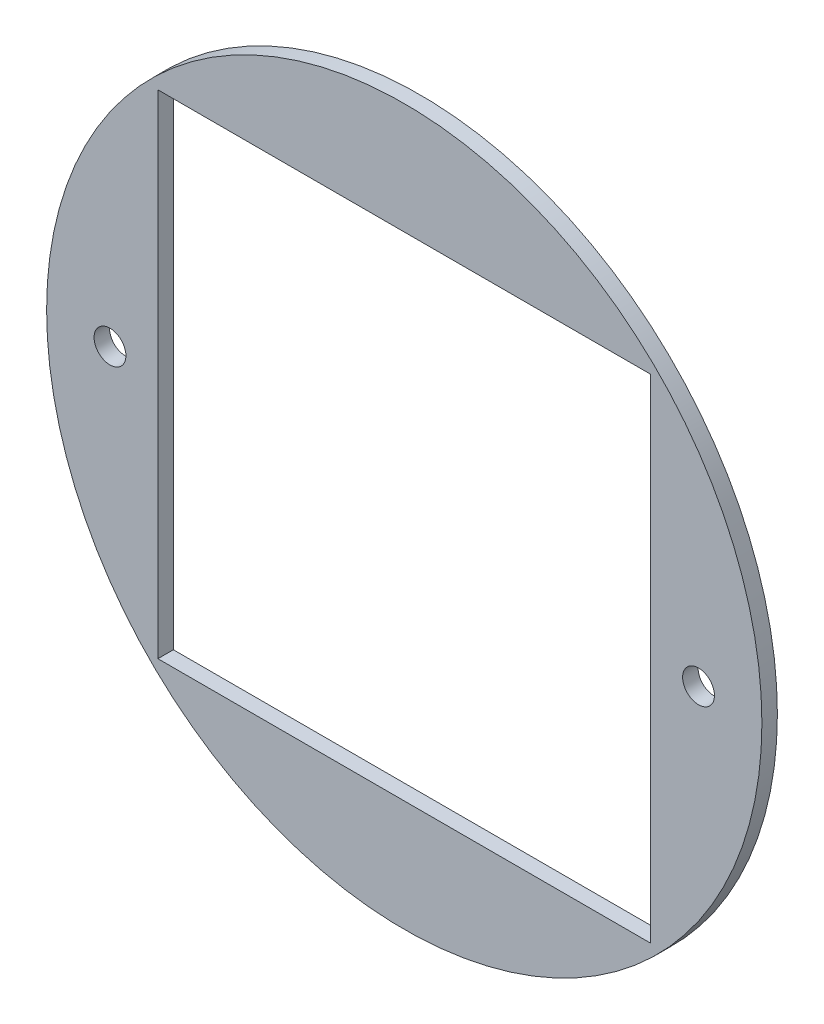
ISO-10303-21;
HEADER;
FILE_DESCRIPTION(('STEP AP214'),'2;1');
FILE_NAME('part.step','',(''),(''),'','','');
FILE_SCHEMA(('AUTOMOTIVE_DESIGN { 1 0 10303 214 1 1 1 1 }'));
ENDSEC;
DATA;
#1=APPLICATION_CONTEXT('core data for automotive mechanical design processes');
#2=APPLICATION_PROTOCOL_DEFINITION('international standard','automotive_design',2000,#1);
#3=PRODUCT_CONTEXT('',#1,'mechanical');
#4=PRODUCT('Part','Part','',(#3));
#5=PRODUCT_RELATED_PRODUCT_CATEGORY('part','',(#4));
#6=PRODUCT_DEFINITION_FORMATION('','',#4);
#7=PRODUCT_DEFINITION_CONTEXT('part definition',#1,'design');
#8=PRODUCT_DEFINITION('design','',#6,#7);
#9=PRODUCT_DEFINITION_SHAPE('','',#8);
#10=(LENGTH_UNIT() NAMED_UNIT(*) SI_UNIT(.MILLI.,.METRE.));
#11=(NAMED_UNIT(*) PLANE_ANGLE_UNIT() SI_UNIT($,.RADIAN.));
#12=(NAMED_UNIT(*) SI_UNIT($,.STERADIAN.) SOLID_ANGLE_UNIT());
#13=UNCERTAINTY_MEASURE_WITH_UNIT(LENGTH_MEASURE(1.E-05),#10,'distance_accuracy_value','');
#14=(GEOMETRIC_REPRESENTATION_CONTEXT(3) GLOBAL_UNCERTAINTY_ASSIGNED_CONTEXT((#13)) GLOBAL_UNIT_ASSIGNED_CONTEXT((#10,
#11,#12)) REPRESENTATION_CONTEXT('',''));
#15=CARTESIAN_POINT('',(0.,0.,0.));
#16=DIRECTION('',(0.,0.,1.));
#17=DIRECTION('',(1.,0.,0.));
#18=AXIS2_PLACEMENT_3D('',#15,#16,#17);
#19=CARTESIAN_POINT('',(0.,0.,3.175));
#20=DIRECTION('',(0.,0.,-1.));
#21=DIRECTION('',(-1.,0.,0.));
#22=AXIS2_PLACEMENT_3D('',#19,#20,#21);
#23=CYLINDRICAL_SURFACE('',#22,73.3171);
#24=CARTESIAN_POINT('',(0.,0.,3.175));
#25=DIRECTION('',(0.,0.,1.));
#26=DIRECTION('',(1.,0.,0.));
#27=AXIS2_PLACEMENT_3D('',#24,#25,#26);
#28=CIRCLE('',#27,73.3171);
#29=CARTESIAN_POINT('',(73.3171,0.,3.175));
#30=VERTEX_POINT('',#29);
#31=EDGE_CURVE('E11',#30,#30,#28,.T.);
#32=ORIENTED_EDGE('',*,*,#31,.F.);
#33=EDGE_LOOP('',(#32));
#34=FACE_BOUND('',#33,.T.);
#35=CARTESIAN_POINT('',(0.,0.,0.));
#36=DIRECTION('',(0.,0.,1.));
#37=DIRECTION('',(1.,0.,0.));
#38=AXIS2_PLACEMENT_3D('',#35,#36,#37);
#39=CIRCLE('',#38,73.3171);
#40=CARTESIAN_POINT('',(73.3171,0.,0.));
#41=VERTEX_POINT('',#40);
#42=EDGE_CURVE('E42',#41,#41,#39,.T.);
#43=ORIENTED_EDGE('',*,*,#42,.T.);
#44=EDGE_LOOP('',(#43));
#45=FACE_BOUND('',#44,.T.);
#46=ADVANCED_FACE('F39',(#34,#45),#23,.T.);
#47=CARTESIAN_POINT('',(0.,0.,3.175));
#48=DIRECTION('',(0.,0.,1.));
#49=DIRECTION('',(1.,0.,0.));
#50=AXIS2_PLACEMENT_3D('',#47,#48,#49);
#51=PLANE('',#50);
#52=DIRECTION('',(0.,1.,0.));
#53=VECTOR('',#52,1.);
#54=CARTESIAN_POINT('',(50.499999965,0.,3.175));
#55=LINE('',#54,#53);
#56=CARTESIAN_POINT('',(50.499999965,-50.499999965,3.175));
#57=VERTEX_POINT('',#56);
#58=CARTESIAN_POINT('',(50.499999965,50.499999965,3.175));
#59=VERTEX_POINT('',#58);
#60=EDGE_CURVE('E85',#57,#59,#55,.T.);
#61=ORIENTED_EDGE('',*,*,#60,.F.);
#62=DIRECTION('',(1.,0.,0.));
#63=VECTOR('',#62,1.);
#64=CARTESIAN_POINT('',(0.,-50.499999965,3.175));
#65=LINE('',#64,#63);
#66=CARTESIAN_POINT('',(-50.499999965,-50.499999965,3.175));
#67=VERTEX_POINT('',#66);
#68=EDGE_CURVE('E112',#67,#57,#65,.T.);
#69=ORIENTED_EDGE('',*,*,#68,.F.);
#70=DIRECTION('',(0.,-1.,0.));
#71=VECTOR('',#70,1.);
#72=CARTESIAN_POINT('',(-50.499999965,0.,3.175));
#73=LINE('',#72,#71);
#74=CARTESIAN_POINT('',(-50.499999965,50.499999965,3.175));
#75=VERTEX_POINT('',#74);
#76=EDGE_CURVE('E110',#75,#67,#73,.T.);
#77=ORIENTED_EDGE('',*,*,#76,.F.);
#78=DIRECTION('',(-1.,0.,0.));
#79=VECTOR('',#78,1.);
#80=CARTESIAN_POINT('',(0.,50.499999965,3.175));
#81=LINE('',#80,#79);
#82=EDGE_CURVE('E104',#59,#75,#81,.T.);
#83=ORIENTED_EDGE('',*,*,#82,.F.);
#84=EDGE_LOOP('',(#61,#69,#77,#83));
#85=FACE_BOUND('',#84,.T.);
#86=CARTESIAN_POINT('',(-60.325,0.,3.175));
#87=DIRECTION('',(0.,0.,1.));
#88=DIRECTION('',(1.,0.,0.));
#89=AXIS2_PLACEMENT_3D('',#86,#87,#88);
#90=CIRCLE('',#89,3.2639);
#91=CARTESIAN_POINT('',(-57.0611,0.,3.175));
#92=VERTEX_POINT('',#91);
#93=EDGE_CURVE('E115',#92,#92,#90,.T.);
#94=ORIENTED_EDGE('',*,*,#93,.F.);
#95=EDGE_LOOP('',(#94));
#96=FACE_BOUND('',#95,.T.);
#97=CARTESIAN_POINT('',(60.325,0.,3.175));
#98=DIRECTION('',(0.,0.,1.));
#99=DIRECTION('',(1.,0.,0.));
#100=AXIS2_PLACEMENT_3D('',#97,#98,#99);
#101=CIRCLE('',#100,3.26389999999999);
#102=CARTESIAN_POINT('',(63.5889,0.,3.175));
#103=VERTEX_POINT('',#102);
#104=EDGE_CURVE('E121',#103,#103,#101,.T.);
#105=ORIENTED_EDGE('',*,*,#104,.F.);
#106=EDGE_LOOP('',(#105));
#107=FACE_BOUND('',#106,.T.);
#108=ORIENTED_EDGE('',*,*,#31,.T.);
#109=EDGE_LOOP('',(#108));
#110=FACE_BOUND('',#109,.T.);
#111=ADVANCED_FACE('F134',(#85,#96,#107,#110),#51,.T.);
#112=CARTESIAN_POINT('',(0.,0.,0.));
#113=DIRECTION('',(0.,0.,1.));
#114=DIRECTION('',(1.,0.,0.));
#115=AXIS2_PLACEMENT_3D('',#112,#113,#114);
#116=PLANE('',#115);
#117=DIRECTION('',(1.,0.,0.));
#118=VECTOR('',#117,1.);
#119=CARTESIAN_POINT('',(-50.499999965,-50.499999965,0.));
#120=LINE('',#119,#118);
#121=CARTESIAN_POINT('',(-50.499999965,-50.499999965,0.));
#122=VERTEX_POINT('',#121);
#123=CARTESIAN_POINT('',(50.499999965,-50.499999965,0.));
#124=VERTEX_POINT('',#123);
#125=EDGE_CURVE('E88',#122,#124,#120,.T.);
#126=ORIENTED_EDGE('',*,*,#125,.T.);
#127=DIRECTION('',(0.,1.,0.));
#128=VECTOR('',#127,1.);
#129=CARTESIAN_POINT('',(50.499999965,-50.499999965,0.));
#130=LINE('',#129,#128);
#131=CARTESIAN_POINT('',(50.499999965,50.499999965,0.));
#132=VERTEX_POINT('',#131);
#133=EDGE_CURVE('E82',#124,#132,#130,.T.);
#134=ORIENTED_EDGE('',*,*,#133,.T.);
#135=DIRECTION('',(-1.,0.,0.));
#136=VECTOR('',#135,1.);
#137=CARTESIAN_POINT('',(-50.499999965,50.499999965,0.));
#138=LINE('',#137,#136);
#139=CARTESIAN_POINT('',(-50.499999965,50.499999965,0.));
#140=VERTEX_POINT('',#139);
#141=EDGE_CURVE('E91',#132,#140,#138,.T.);
#142=ORIENTED_EDGE('',*,*,#141,.T.);
#143=DIRECTION('',(0.,-1.,0.));
#144=VECTOR('',#143,1.);
#145=CARTESIAN_POINT('',(-50.499999965,-50.499999965,0.));
#146=LINE('',#145,#144);
#147=EDGE_CURVE('E61',#140,#122,#146,.T.);
#148=ORIENTED_EDGE('',*,*,#147,.T.);
#149=EDGE_LOOP('',(#126,#134,#142,#148));
#150=FACE_BOUND('',#149,.T.);
#151=CARTESIAN_POINT('',(-60.325,0.,0.));
#152=DIRECTION('',(0.,0.,1.));
#153=DIRECTION('',(1.,0.,0.));
#154=AXIS2_PLACEMENT_3D('',#151,#152,#153);
#155=CIRCLE('',#154,3.2639);
#156=CARTESIAN_POINT('',(-57.0611,0.,0.));
#157=VERTEX_POINT('',#156);
#158=EDGE_CURVE('E118',#157,#157,#155,.T.);
#159=ORIENTED_EDGE('',*,*,#158,.T.);
#160=EDGE_LOOP('',(#159));
#161=FACE_BOUND('',#160,.T.);
#162=CARTESIAN_POINT('',(60.325,0.,0.));
#163=DIRECTION('',(0.,0.,1.));
#164=DIRECTION('',(1.,0.,0.));
#165=AXIS2_PLACEMENT_3D('',#162,#163,#164);
#166=CIRCLE('',#165,3.26389999999999);
#167=CARTESIAN_POINT('',(63.5889,0.,0.));
#168=VERTEX_POINT('',#167);
#169=EDGE_CURVE('E124',#168,#168,#166,.T.);
#170=ORIENTED_EDGE('',*,*,#169,.T.);
#171=EDGE_LOOP('',(#170));
#172=FACE_BOUND('',#171,.T.);
#173=ORIENTED_EDGE('',*,*,#42,.F.);
#174=EDGE_LOOP('',(#173));
#175=FACE_BOUND('',#174,.T.);
#176=ADVANCED_FACE('F95',(#150,#161,#172,#175),#116,.F.);
#177=CARTESIAN_POINT('',(60.325,0.,3.175));
#178=DIRECTION('',(0.,0.,1.));
#179=DIRECTION('',(1.,0.,0.));
#180=AXIS2_PLACEMENT_3D('',#177,#178,#179);
#181=CYLINDRICAL_SURFACE('',#180,3.26389999999999);
#182=ORIENTED_EDGE('',*,*,#169,.F.);
#183=EDGE_LOOP('',(#182));
#184=FACE_BOUND('',#183,.T.);
#185=ORIENTED_EDGE('',*,*,#104,.T.);
#186=EDGE_LOOP('',(#185));
#187=FACE_BOUND('',#186,.T.);
#188=ADVANCED_FACE('F133',(#184,#187),#181,.F.);
#189=CARTESIAN_POINT('',(-60.325,0.,3.175));
#190=DIRECTION('',(0.,0.,1.));
#191=DIRECTION('',(1.,0.,0.));
#192=AXIS2_PLACEMENT_3D('',#189,#190,#191);
#193=CYLINDRICAL_SURFACE('',#192,3.2639);
#194=ORIENTED_EDGE('',*,*,#158,.F.);
#195=EDGE_LOOP('',(#194));
#196=FACE_BOUND('',#195,.T.);
#197=ORIENTED_EDGE('',*,*,#93,.T.);
#198=EDGE_LOOP('',(#197));
#199=FACE_BOUND('',#198,.T.);
#200=ADVANCED_FACE('F140',(#196,#199),#193,.F.);
#201=CARTESIAN_POINT('',(50.499999965,-50.499999965,0.));
#202=DIRECTION('',(1.,0.,0.));
#203=DIRECTION('',(0.,0.,-1.));
#204=AXIS2_PLACEMENT_3D('',#201,#202,#203);
#205=PLANE('',#204);
#206=ORIENTED_EDGE('',*,*,#60,.T.);
#207=DIRECTION('',(0.,0.,1.));
#208=VECTOR('',#207,1.);
#209=CARTESIAN_POINT('',(50.499999965,50.499999965,0.));
#210=LINE('',#209,#208);
#211=EDGE_CURVE('E53',#132,#59,#210,.T.);
#212=ORIENTED_EDGE('',*,*,#211,.F.);
#213=ORIENTED_EDGE('',*,*,#133,.F.);
#214=DIRECTION('',(0.,0.,1.));
#215=VECTOR('',#214,1.);
#216=CARTESIAN_POINT('',(50.499999965,-50.499999965,0.));
#217=LINE('',#216,#215);
#218=EDGE_CURVE('E102',#124,#57,#217,.T.);
#219=ORIENTED_EDGE('',*,*,#218,.T.);
#220=EDGE_LOOP('',(#206,#212,#213,#219));
#221=FACE_BOUND('',#220,.T.);
#222=ADVANCED_FACE('F79',(#221),#205,.F.);
#223=CARTESIAN_POINT('',(-50.499999965,-50.499999965,0.));
#224=DIRECTION('',(0.,-1.,0.));
#225=DIRECTION('',(0.,0.,-1.));
#226=AXIS2_PLACEMENT_3D('',#223,#224,#225);
#227=PLANE('',#226);
#228=ORIENTED_EDGE('',*,*,#68,.T.);
#229=ORIENTED_EDGE('',*,*,#218,.F.);
#230=ORIENTED_EDGE('',*,*,#125,.F.);
#231=DIRECTION('',(0.,0.,1.));
#232=VECTOR('',#231,1.);
#233=CARTESIAN_POINT('',(-50.499999965,-50.499999965,0.));
#234=LINE('',#233,#232);
#235=EDGE_CURVE('E105',#122,#67,#234,.T.);
#236=ORIENTED_EDGE('',*,*,#235,.T.);
#237=EDGE_LOOP('',(#228,#229,#230,#236));
#238=FACE_BOUND('',#237,.T.);
#239=ADVANCED_FACE('F183',(#238),#227,.F.);
#240=CARTESIAN_POINT('',(-50.499999965,-50.499999965,0.));
#241=DIRECTION('',(-1.,0.,0.));
#242=DIRECTION('',(0.,0.,1.));
#243=AXIS2_PLACEMENT_3D('',#240,#241,#242);
#244=PLANE('',#243);
#245=ORIENTED_EDGE('',*,*,#76,.T.);
#246=ORIENTED_EDGE('',*,*,#235,.F.);
#247=ORIENTED_EDGE('',*,*,#147,.F.);
#248=DIRECTION('',(0.,0.,1.));
#249=VECTOR('',#248,1.);
#250=CARTESIAN_POINT('',(-50.499999965,50.499999965,0.));
#251=LINE('',#250,#249);
#252=EDGE_CURVE('E87',#140,#75,#251,.T.);
#253=ORIENTED_EDGE('',*,*,#252,.T.);
#254=EDGE_LOOP('',(#245,#246,#247,#253));
#255=FACE_BOUND('',#254,.T.);
#256=ADVANCED_FACE('F191',(#255),#244,.F.);
#257=CARTESIAN_POINT('',(-50.499999965,50.499999965,0.));
#258=DIRECTION('',(0.,1.,0.));
#259=DIRECTION('',(0.,0.,1.));
#260=AXIS2_PLACEMENT_3D('',#257,#258,#259);
#261=PLANE('',#260);
#262=ORIENTED_EDGE('',*,*,#82,.T.);
#263=ORIENTED_EDGE('',*,*,#252,.F.);
#264=ORIENTED_EDGE('',*,*,#141,.F.);
#265=ORIENTED_EDGE('',*,*,#211,.T.);
#266=EDGE_LOOP('',(#262,#263,#264,#265));
#267=FACE_BOUND('',#266,.T.);
#268=ADVANCED_FACE('F92',(#267),#261,.F.);
#269=CLOSED_SHELL('',(#46,#111,#176,#188,#200,#222,#239,#256,#268));
#270=MANIFOLD_SOLID_BREP('B2',#269);
#271=ADVANCED_BREP_SHAPE_REPRESENTATION('',(#18,#270),#14);
#272=SHAPE_DEFINITION_REPRESENTATION(#9,#271);
ENDSEC;
END-ISO-10303-21;
